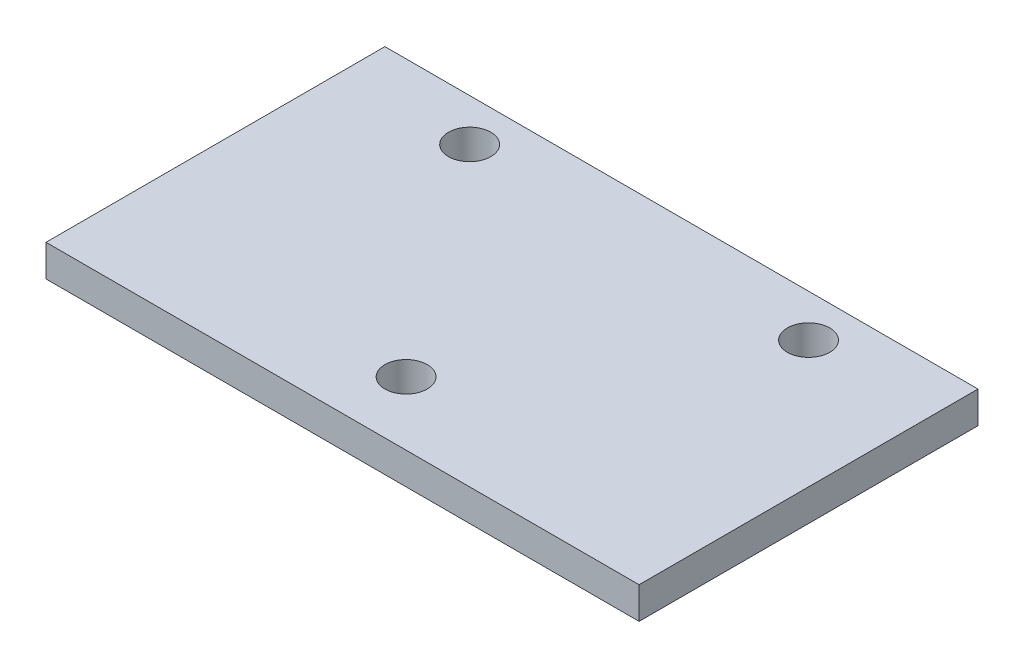
ISO-10303-21;
HEADER;
FILE_DESCRIPTION(('STEP AP214'),'2;1');
FILE_NAME('part.step','',(''),(''),'','','');
FILE_SCHEMA(('AUTOMOTIVE_DESIGN { 1 0 10303 214 1 1 1 1 }'));
ENDSEC;
DATA;
#1=APPLICATION_CONTEXT('core data for automotive mechanical design processes');
#2=APPLICATION_PROTOCOL_DEFINITION('international standard','automotive_design',2000,#1);
#3=PRODUCT_CONTEXT('',#1,'mechanical');
#4=PRODUCT('Part','Part','',(#3));
#5=PRODUCT_RELATED_PRODUCT_CATEGORY('part','',(#4));
#6=PRODUCT_DEFINITION_FORMATION('','',#4);
#7=PRODUCT_DEFINITION_CONTEXT('part definition',#1,'design');
#8=PRODUCT_DEFINITION('design','',#6,#7);
#9=PRODUCT_DEFINITION_SHAPE('','',#8);
#10=(LENGTH_UNIT() NAMED_UNIT(*) SI_UNIT(.MILLI.,.METRE.));
#11=(NAMED_UNIT(*) PLANE_ANGLE_UNIT() SI_UNIT($,.RADIAN.));
#12=(NAMED_UNIT(*) SI_UNIT($,.STERADIAN.) SOLID_ANGLE_UNIT());
#13=UNCERTAINTY_MEASURE_WITH_UNIT(LENGTH_MEASURE(1.E-05),#10,'distance_accuracy_value','');
#14=(GEOMETRIC_REPRESENTATION_CONTEXT(3) GLOBAL_UNCERTAINTY_ASSIGNED_CONTEXT((#13)) GLOBAL_UNIT_ASSIGNED_CONTEXT((#10,
#11,#12)) REPRESENTATION_CONTEXT('',''));
#15=CARTESIAN_POINT('',(0.,0.,0.));
#16=DIRECTION('',(0.,0.,1.));
#17=DIRECTION('',(1.,0.,0.));
#18=AXIS2_PLACEMENT_3D('',#15,#16,#17);
#19=CARTESIAN_POINT('',(-88.9,9.525,50.8));
#20=DIRECTION('',(-1.,0.,0.));
#21=DIRECTION('',(0.,0.,1.));
#22=AXIS2_PLACEMENT_3D('',#19,#20,#21);
#23=PLANE('',#22);
#24=DIRECTION('',(0.,0.,-1.));
#25=VECTOR('',#24,1.);
#26=CARTESIAN_POINT('',(-88.9,0.,50.8));
#27=LINE('',#26,#25);
#28=CARTESIAN_POINT('',(-88.9,0.,50.8));
#29=VERTEX_POINT('',#28);
#30=CARTESIAN_POINT('',(-88.9,0.,-50.8));
#31=VERTEX_POINT('',#30);
#32=EDGE_CURVE('E112',#29,#31,#27,.T.);
#33=ORIENTED_EDGE('',*,*,#32,.F.);
#34=DIRECTION('',(0.,-1.,0.));
#35=VECTOR('',#34,1.);
#36=CARTESIAN_POINT('',(-88.9,9.525,50.8));
#37=LINE('',#36,#35);
#38=CARTESIAN_POINT('',(-88.9,9.525,50.8));
#39=VERTEX_POINT('',#38);
#40=EDGE_CURVE('E11',#39,#29,#37,.T.);
#41=ORIENTED_EDGE('',*,*,#40,.F.);
#42=DIRECTION('',(0.,0.,-1.));
#43=VECTOR('',#42,1.);
#44=CARTESIAN_POINT('',(-88.9,9.525,50.8));
#45=LINE('',#44,#43);
#46=CARTESIAN_POINT('',(-88.9,9.525,-50.8));
#47=VERTEX_POINT('',#46);
#48=EDGE_CURVE('E101',#39,#47,#45,.T.);
#49=ORIENTED_EDGE('',*,*,#48,.T.);
#50=DIRECTION('',(0.,-1.,0.));
#51=VECTOR('',#50,1.);
#52=CARTESIAN_POINT('',(-88.9,9.525,-50.8));
#53=LINE('',#52,#51);
#54=EDGE_CURVE('E43',#47,#31,#53,.T.);
#55=ORIENTED_EDGE('',*,*,#54,.T.);
#56=EDGE_LOOP('',(#33,#41,#49,#55));
#57=FACE_BOUND('',#56,.T.);
#58=ADVANCED_FACE('F40',(#57),#23,.T.);
#59=CARTESIAN_POINT('',(-88.9,9.525,50.8));
#60=DIRECTION('',(0.,0.,-1.));
#61=DIRECTION('',(-1.,0.,0.));
#62=AXIS2_PLACEMENT_3D('',#59,#60,#61);
#63=PLANE('',#62);
#64=DIRECTION('',(1.,0.,0.));
#65=VECTOR('',#64,1.);
#66=CARTESIAN_POINT('',(-88.9,0.,50.8));
#67=LINE('',#66,#65);
#68=CARTESIAN_POINT('',(88.9,0.,50.8));
#69=VERTEX_POINT('',#68);
#70=EDGE_CURVE('E121',#29,#69,#67,.T.);
#71=ORIENTED_EDGE('',*,*,#70,.T.);
#72=DIRECTION('',(0.,-1.,0.));
#73=VECTOR('',#72,1.);
#74=CARTESIAN_POINT('',(88.9,9.525,50.8));
#75=LINE('',#74,#73);
#76=CARTESIAN_POINT('',(88.9,9.525,50.8));
#77=VERTEX_POINT('',#76);
#78=EDGE_CURVE('E49',#77,#69,#75,.T.);
#79=ORIENTED_EDGE('',*,*,#78,.F.);
#80=DIRECTION('',(1.,0.,0.));
#81=VECTOR('',#80,1.);
#82=CARTESIAN_POINT('',(-88.9,9.525,50.8));
#83=LINE('',#82,#81);
#84=EDGE_CURVE('E104',#39,#77,#83,.T.);
#85=ORIENTED_EDGE('',*,*,#84,.F.);
#86=ORIENTED_EDGE('',*,*,#40,.T.);
#87=EDGE_LOOP('',(#71,#79,#85,#86));
#88=FACE_BOUND('',#87,.T.);
#89=ADVANCED_FACE('F180',(#88),#63,.F.);
#90=CARTESIAN_POINT('',(88.9,9.525,-50.8));
#91=DIRECTION('',(1.,0.,0.));
#92=DIRECTION('',(0.,0.,-1.));
#93=AXIS2_PLACEMENT_3D('',#90,#91,#92);
#94=PLANE('',#93);
#95=DIRECTION('',(0.,0.,1.));
#96=VECTOR('',#95,1.);
#97=CARTESIAN_POINT('',(88.9,0.,-50.8));
#98=LINE('',#97,#96);
#99=CARTESIAN_POINT('',(88.9,0.,-50.8));
#100=VERTEX_POINT('',#99);
#101=EDGE_CURVE('E94',#100,#69,#98,.T.);
#102=ORIENTED_EDGE('',*,*,#101,.F.);
#103=DIRECTION('',(0.,-1.,0.));
#104=VECTOR('',#103,1.);
#105=CARTESIAN_POINT('',(88.9,9.525,-50.8));
#106=LINE('',#105,#104);
#107=CARTESIAN_POINT('',(88.9,9.525,-50.8));
#108=VERTEX_POINT('',#107);
#109=EDGE_CURVE('E90',#108,#100,#106,.T.);
#110=ORIENTED_EDGE('',*,*,#109,.F.);
#111=DIRECTION('',(0.,0.,1.));
#112=VECTOR('',#111,1.);
#113=CARTESIAN_POINT('',(88.9,9.525,-50.8));
#114=LINE('',#113,#112);
#115=EDGE_CURVE('E92',#108,#77,#114,.T.);
#116=ORIENTED_EDGE('',*,*,#115,.T.);
#117=ORIENTED_EDGE('',*,*,#78,.T.);
#118=EDGE_LOOP('',(#102,#110,#116,#117));
#119=FACE_BOUND('',#118,.T.);
#120=ADVANCED_FACE('F91',(#119),#94,.T.);
#121=CARTESIAN_POINT('',(88.9,9.525,-50.8));
#122=DIRECTION('',(0.,0.,1.));
#123=DIRECTION('',(1.,0.,0.));
#124=AXIS2_PLACEMENT_3D('',#121,#122,#123);
#125=PLANE('',#124);
#126=DIRECTION('',(-1.,0.,0.));
#127=VECTOR('',#126,1.);
#128=CARTESIAN_POINT('',(88.9,0.,-50.8));
#129=LINE('',#128,#127);
#130=EDGE_CURVE('E116',#100,#31,#129,.T.);
#131=ORIENTED_EDGE('',*,*,#130,.T.);
#132=ORIENTED_EDGE('',*,*,#54,.F.);
#133=DIRECTION('',(-1.,0.,0.));
#134=VECTOR('',#133,1.);
#135=CARTESIAN_POINT('',(88.9,9.525,-50.8));
#136=LINE('',#135,#134);
#137=EDGE_CURVE('E86',#108,#47,#136,.T.);
#138=ORIENTED_EDGE('',*,*,#137,.F.);
#139=ORIENTED_EDGE('',*,*,#109,.T.);
#140=EDGE_LOOP('',(#131,#132,#138,#139));
#141=FACE_BOUND('',#140,.T.);
#142=ADVANCED_FACE('F99',(#141),#125,.F.);
#143=CARTESIAN_POINT('',(-88.9,9.525,50.8));
#144=DIRECTION('',(0.,-1.,0.));
#145=DIRECTION('',(0.,0.,-1.));
#146=AXIS2_PLACEMENT_3D('',#143,#144,#145);
#147=PLANE('',#146);
#148=CARTESIAN_POINT('',(0.,9.525,31.75));
#149=DIRECTION('',(0.,1.,0.));
#150=DIRECTION('',(0.,0.,1.));
#151=AXIS2_PLACEMENT_3D('',#148,#149,#150);
#152=CIRCLE('',#151,6.35);
#153=CARTESIAN_POINT('',(0.,9.525,38.1));
#154=VERTEX_POINT('',#153);
#155=EDGE_CURVE('E142',#154,#154,#152,.T.);
#156=ORIENTED_EDGE('',*,*,#155,.F.);
#157=EDGE_LOOP('',(#156));
#158=FACE_BOUND('',#157,.T.);
#159=CARTESIAN_POINT('',(50.8,9.525,-38.1));
#160=DIRECTION('',(0.,1.,0.));
#161=DIRECTION('',(0.,0.,1.));
#162=AXIS2_PLACEMENT_3D('',#159,#160,#161);
#163=CIRCLE('',#162,6.35);
#164=CARTESIAN_POINT('',(50.8,9.525,-31.75));
#165=VERTEX_POINT('',#164);
#166=EDGE_CURVE('E135',#165,#165,#163,.T.);
#167=ORIENTED_EDGE('',*,*,#166,.F.);
#168=EDGE_LOOP('',(#167));
#169=FACE_BOUND('',#168,.T.);
#170=CARTESIAN_POINT('',(-50.8,9.525,-38.1));
#171=DIRECTION('',(0.,1.,0.));
#172=DIRECTION('',(0.,0.,1.));
#173=AXIS2_PLACEMENT_3D('',#170,#171,#172);
#174=CIRCLE('',#173,6.35);
#175=CARTESIAN_POINT('',(-50.8,9.525,-31.75));
#176=VERTEX_POINT('',#175);
#177=EDGE_CURVE('E127',#176,#176,#174,.T.);
#178=ORIENTED_EDGE('',*,*,#177,.F.);
#179=EDGE_LOOP('',(#178));
#180=FACE_BOUND('',#179,.T.);
#181=ORIENTED_EDGE('',*,*,#48,.F.);
#182=ORIENTED_EDGE('',*,*,#84,.T.);
#183=ORIENTED_EDGE('',*,*,#115,.F.);
#184=ORIENTED_EDGE('',*,*,#137,.T.);
#185=EDGE_LOOP('',(#181,#182,#183,#184));
#186=FACE_BOUND('',#185,.T.);
#187=ADVANCED_FACE('F103',(#158,#169,#180,#186),#147,.F.);
#188=CARTESIAN_POINT('',(-88.9,0.,50.8));
#189=DIRECTION('',(0.,-1.,0.));
#190=DIRECTION('',(0.,0.,-1.));
#191=AXIS2_PLACEMENT_3D('',#188,#189,#190);
#192=PLANE('',#191);
#193=CARTESIAN_POINT('',(0.,0.,31.75));
#194=DIRECTION('',(0.,1.,0.));
#195=DIRECTION('',(0.,0.,1.));
#196=AXIS2_PLACEMENT_3D('',#193,#194,#195);
#197=CIRCLE('',#196,6.35);
#198=CARTESIAN_POINT('',(0.,0.,38.1));
#199=VERTEX_POINT('',#198);
#200=EDGE_CURVE('E139',#199,#199,#197,.T.);
#201=ORIENTED_EDGE('',*,*,#200,.T.);
#202=EDGE_LOOP('',(#201));
#203=FACE_BOUND('',#202,.T.);
#204=CARTESIAN_POINT('',(50.8,0.,-38.1));
#205=DIRECTION('',(0.,1.,0.));
#206=DIRECTION('',(0.,0.,1.));
#207=AXIS2_PLACEMENT_3D('',#204,#205,#206);
#208=CIRCLE('',#207,6.35);
#209=CARTESIAN_POINT('',(50.8,0.,-31.75));
#210=VERTEX_POINT('',#209);
#211=EDGE_CURVE('E131',#210,#210,#208,.T.);
#212=ORIENTED_EDGE('',*,*,#211,.T.);
#213=EDGE_LOOP('',(#212));
#214=FACE_BOUND('',#213,.T.);
#215=CARTESIAN_POINT('',(-50.8,0.,-38.1));
#216=DIRECTION('',(0.,1.,0.));
#217=DIRECTION('',(0.,0.,1.));
#218=AXIS2_PLACEMENT_3D('',#215,#216,#217);
#219=CIRCLE('',#218,6.35);
#220=CARTESIAN_POINT('',(-50.8,0.,-31.75));
#221=VERTEX_POINT('',#220);
#222=EDGE_CURVE('E117',#221,#221,#219,.T.);
#223=ORIENTED_EDGE('',*,*,#222,.T.);
#224=EDGE_LOOP('',(#223));
#225=FACE_BOUND('',#224,.T.);
#226=ORIENTED_EDGE('',*,*,#32,.T.);
#227=ORIENTED_EDGE('',*,*,#130,.F.);
#228=ORIENTED_EDGE('',*,*,#101,.T.);
#229=ORIENTED_EDGE('',*,*,#70,.F.);
#230=EDGE_LOOP('',(#226,#227,#228,#229));
#231=FACE_BOUND('',#230,.T.);
#232=ADVANCED_FACE('F150',(#203,#214,#225,#231),#192,.T.);
#233=CARTESIAN_POINT('',(-50.8,0.,-38.1));
#234=DIRECTION('',(0.,1.,0.));
#235=DIRECTION('',(0.,0.,1.));
#236=AXIS2_PLACEMENT_3D('',#233,#234,#235);
#237=CYLINDRICAL_SURFACE('',#236,6.35);
#238=ORIENTED_EDGE('',*,*,#222,.F.);
#239=EDGE_LOOP('',(#238));
#240=FACE_BOUND('',#239,.T.);
#241=ORIENTED_EDGE('',*,*,#177,.T.);
#242=EDGE_LOOP('',(#241));
#243=FACE_BOUND('',#242,.T.);
#244=ADVANCED_FACE('F167',(#240,#243),#237,.F.);
#245=CARTESIAN_POINT('',(50.8,0.,-38.1));
#246=DIRECTION('',(0.,1.,0.));
#247=DIRECTION('',(0.,0.,1.));
#248=AXIS2_PLACEMENT_3D('',#245,#246,#247);
#249=CYLINDRICAL_SURFACE('',#248,6.35);
#250=ORIENTED_EDGE('',*,*,#211,.F.);
#251=EDGE_LOOP('',(#250));
#252=FACE_BOUND('',#251,.T.);
#253=ORIENTED_EDGE('',*,*,#166,.T.);
#254=EDGE_LOOP('',(#253));
#255=FACE_BOUND('',#254,.T.);
#256=ADVANCED_FACE('F156',(#252,#255),#249,.F.);
#257=CARTESIAN_POINT('',(0.,0.,31.75));
#258=DIRECTION('',(0.,1.,0.));
#259=DIRECTION('',(0.,0.,1.));
#260=AXIS2_PLACEMENT_3D('',#257,#258,#259);
#261=CYLINDRICAL_SURFACE('',#260,6.35);
#262=ORIENTED_EDGE('',*,*,#200,.F.);
#263=EDGE_LOOP('',(#262));
#264=FACE_BOUND('',#263,.T.);
#265=ORIENTED_EDGE('',*,*,#155,.T.);
#266=EDGE_LOOP('',(#265));
#267=FACE_BOUND('',#266,.T.);
#268=ADVANCED_FACE('F153',(#264,#267),#261,.F.);
#269=CLOSED_SHELL('',(#58,#89,#120,#142,#187,#232,#244,#256,#268));
#270=MANIFOLD_SOLID_BREP('B2',#269);
#271=ADVANCED_BREP_SHAPE_REPRESENTATION('',(#18,#270),#14);
#272=SHAPE_DEFINITION_REPRESENTATION(#9,#271);
ENDSEC;
END-ISO-10303-21;
